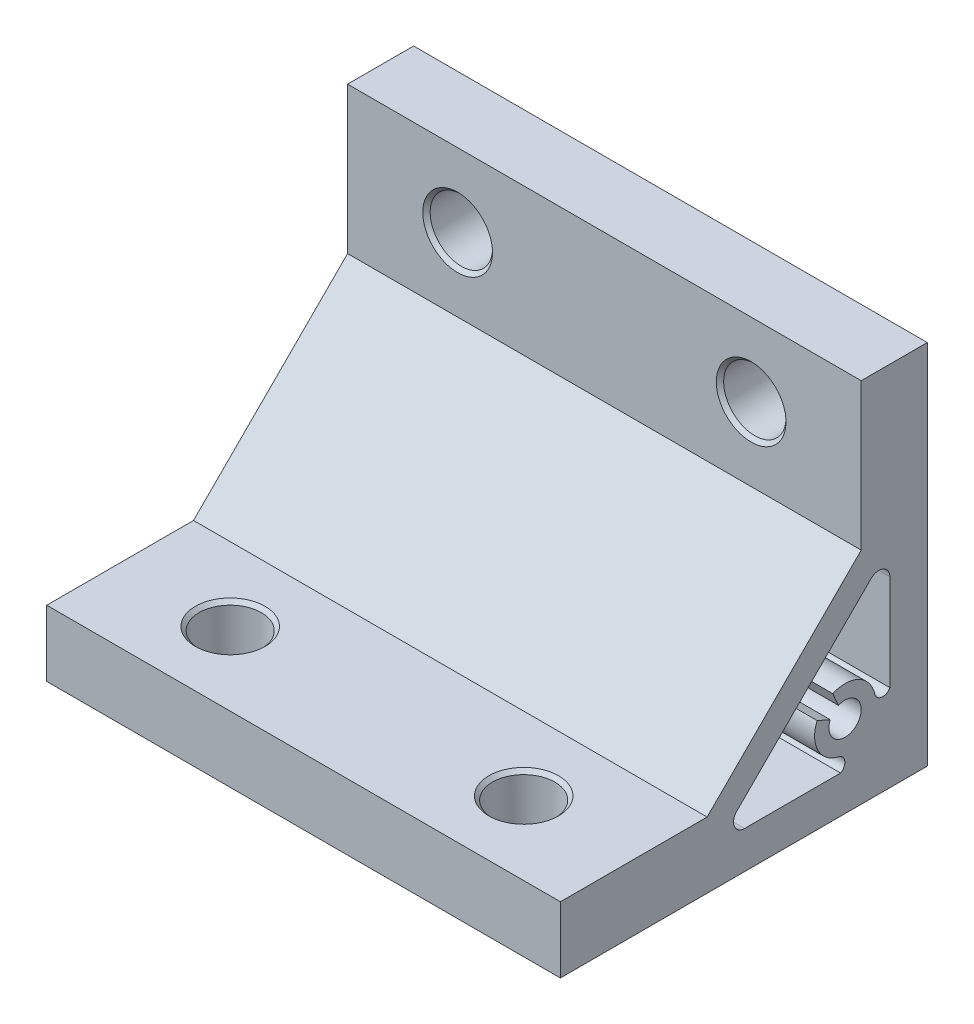
ISO-10303-21;
HEADER;
FILE_DESCRIPTION(('STEP AP214'),'2;1');
FILE_NAME('part.step','',(''),(''),'','','');
FILE_SCHEMA(('AUTOMOTIVE_DESIGN { 1 0 10303 214 1 1 1 1 }'));
ENDSEC;
DATA;
#1=APPLICATION_CONTEXT('core data for automotive mechanical design processes');
#2=APPLICATION_PROTOCOL_DEFINITION('international standard','automotive_design',2000,#1);
#3=PRODUCT_CONTEXT('',#1,'mechanical');
#4=PRODUCT('Part','Part','',(#3));
#5=PRODUCT_RELATED_PRODUCT_CATEGORY('part','',(#4));
#6=PRODUCT_DEFINITION_FORMATION('','',#4);
#7=PRODUCT_DEFINITION_CONTEXT('part definition',#1,'design');
#8=PRODUCT_DEFINITION('design','',#6,#7);
#9=PRODUCT_DEFINITION_SHAPE('','',#8);
#10=(LENGTH_UNIT() NAMED_UNIT(*) SI_UNIT(.MILLI.,.METRE.));
#11=(NAMED_UNIT(*) PLANE_ANGLE_UNIT() SI_UNIT($,.RADIAN.));
#12=(NAMED_UNIT(*) SI_UNIT($,.STERADIAN.) SOLID_ANGLE_UNIT());
#13=UNCERTAINTY_MEASURE_WITH_UNIT(LENGTH_MEASURE(1.E-05),#10,'distance_accuracy_value','');
#14=(GEOMETRIC_REPRESENTATION_CONTEXT(3) GLOBAL_UNCERTAINTY_ASSIGNED_CONTEXT((#13)) GLOBAL_UNIT_ASSIGNED_CONTEXT((#10,
#11,#12)) REPRESENTATION_CONTEXT('',''));
#15=CARTESIAN_POINT('',(0.,0.,0.));
#16=DIRECTION('',(0.,0.,1.));
#17=DIRECTION('',(1.,0.,0.));
#18=AXIS2_PLACEMENT_3D('',#15,#16,#17);
#19=CARTESIAN_POINT('',(20.,9.,25.));
#20=DIRECTION('',(0.,0.,-1.));
#21=DIRECTION('',(0.,1.,0.));
#22=AXIS2_PLACEMENT_3D('',#19,#20,#21);
#23=PLANE('',#22);
#24=DIRECTION('',(0.,-1.,0.));
#25=VECTOR('',#24,1.);
#26=CARTESIAN_POINT('',(-15.,50.,25.));
#27=LINE('',#26,#25);
#28=CARTESIAN_POINT('',(-15.,9.,25.));
#29=VERTEX_POINT('',#28);
#30=CARTESIAN_POINT('',(-15.,0.,25.));
#31=VERTEX_POINT('',#30);
#32=EDGE_CURVE('E39',#29,#31,#27,.T.);
#33=ORIENTED_EDGE('',*,*,#32,.T.);
#34=DIRECTION('',(-1.,0.,0.));
#35=VECTOR('',#34,1.);
#36=CARTESIAN_POINT('',(20.,0.,25.));
#37=LINE('',#36,#35);
#38=CARTESIAN_POINT('',(55.,0.,25.));
#39=VERTEX_POINT('',#38);
#40=EDGE_CURVE('E164',#39,#31,#37,.T.);
#41=ORIENTED_EDGE('',*,*,#40,.F.);
#42=DIRECTION('',(0.,1.,0.));
#43=VECTOR('',#42,1.);
#44=CARTESIAN_POINT('',(55.,50.,25.));
#45=LINE('',#44,#43);
#46=CARTESIAN_POINT('',(55.,9.,25.));
#47=VERTEX_POINT('',#46);
#48=EDGE_CURVE('E155',#39,#47,#45,.T.);
#49=ORIENTED_EDGE('',*,*,#48,.T.);
#50=DIRECTION('',(-1.,0.,0.));
#51=VECTOR('',#50,1.);
#52=CARTESIAN_POINT('',(20.,9.,25.));
#53=LINE('',#52,#51);
#54=EDGE_CURVE('E298',#47,#29,#53,.T.);
#55=ORIENTED_EDGE('',*,*,#54,.T.);
#56=EDGE_LOOP('',(#33,#41,#49,#55));
#57=FACE_BOUND('',#56,.T.);
#58=ADVANCED_FACE('F16',(#57),#23,.F.);
#59=CARTESIAN_POINT('',(20.,0.,25.));
#60=DIRECTION('',(0.,1.,0.));
#61=DIRECTION('',(0.,0.,1.));
#62=AXIS2_PLACEMENT_3D('',#59,#60,#61);
#63=PLANE('',#62);
#64=CARTESIAN_POINT('',(0.,0.,15.));
#65=DIRECTION('',(0.,1.,0.));
#66=DIRECTION('',(0.,0.,1.));
#67=AXIS2_PLACEMENT_3D('',#64,#65,#66);
#68=CIRCLE('',#67,4.75);
#69=CARTESIAN_POINT('',(0.,0.,19.75));
#70=VERTEX_POINT('',#69);
#71=EDGE_CURVE('E188',#70,#70,#68,.T.);
#72=ORIENTED_EDGE('',*,*,#71,.T.);
#73=EDGE_LOOP('',(#72));
#74=FACE_BOUND('',#73,.T.);
#75=CARTESIAN_POINT('',(40.,0.,15.));
#76=DIRECTION('',(0.,-1.,0.));
#77=DIRECTION('',(0.,0.,1.));
#78=AXIS2_PLACEMENT_3D('',#75,#76,#77);
#79=CIRCLE('',#78,4.75);
#80=CARTESIAN_POINT('',(40.,0.,19.75));
#81=VERTEX_POINT('',#80);
#82=EDGE_CURVE('E271',#81,#81,#79,.T.);
#83=ORIENTED_EDGE('',*,*,#82,.F.);
#84=EDGE_LOOP('',(#83));
#85=FACE_BOUND('',#84,.T.);
#86=DIRECTION('',(0.,0.,1.));
#87=VECTOR('',#86,1.);
#88=CARTESIAN_POINT('',(-15.,0.,-25.));
#89=LINE('',#88,#87);
#90=CARTESIAN_POINT('',(-15.,0.,-25.));
#91=VERTEX_POINT('',#90);
#92=EDGE_CURVE('E147',#91,#31,#89,.T.);
#93=ORIENTED_EDGE('',*,*,#92,.F.);
#94=DIRECTION('',(-1.,0.,0.));
#95=VECTOR('',#94,1.);
#96=CARTESIAN_POINT('',(20.,0.,-25.));
#97=LINE('',#96,#95);
#98=CARTESIAN_POINT('',(55.,0.,-25.));
#99=VERTEX_POINT('',#98);
#100=EDGE_CURVE('E162',#99,#91,#97,.T.);
#101=ORIENTED_EDGE('',*,*,#100,.F.);
#102=DIRECTION('',(0.,0.,1.));
#103=VECTOR('',#102,1.);
#104=CARTESIAN_POINT('',(55.,0.,-25.));
#105=LINE('',#104,#103);
#106=EDGE_CURVE('E165',#99,#39,#105,.T.);
#107=ORIENTED_EDGE('',*,*,#106,.T.);
#108=ORIENTED_EDGE('',*,*,#40,.T.);
#109=EDGE_LOOP('',(#93,#101,#107,#108));
#110=FACE_BOUND('',#109,.T.);
#111=ADVANCED_FACE('F160',(#74,#85,#110),#63,.F.);
#112=CARTESIAN_POINT('',(20.,0.,-25.));
#113=DIRECTION('',(0.,0.,1.));
#114=DIRECTION('',(0.,-1.,0.));
#115=AXIS2_PLACEMENT_3D('',#112,#113,#114);
#116=PLANE('',#115);
#117=CARTESIAN_POINT('',(0.,40.,-25.));
#118=DIRECTION('',(0.,0.,1.));
#119=DIRECTION('',(0.,-1.,0.));
#120=AXIS2_PLACEMENT_3D('',#117,#118,#119);
#121=CIRCLE('',#120,4.74999999999999);
#122=CARTESIAN_POINT('',(0.,35.25,-25.));
#123=VERTEX_POINT('',#122);
#124=EDGE_CURVE('E197',#123,#123,#121,.T.);
#125=ORIENTED_EDGE('',*,*,#124,.T.);
#126=EDGE_LOOP('',(#125));
#127=FACE_BOUND('',#126,.T.);
#128=CARTESIAN_POINT('',(40.,40.,-25.));
#129=DIRECTION('',(0.,0.,-1.));
#130=DIRECTION('',(0.,-1.,0.));
#131=AXIS2_PLACEMENT_3D('',#128,#129,#130);
#132=CIRCLE('',#131,4.74999999999999);
#133=CARTESIAN_POINT('',(40.,35.25,-25.));
#134=VERTEX_POINT('',#133);
#135=EDGE_CURVE('E280',#134,#134,#132,.T.);
#136=ORIENTED_EDGE('',*,*,#135,.F.);
#137=EDGE_LOOP('',(#136));
#138=FACE_BOUND('',#137,.T.);
#139=DIRECTION('',(0.,-1.,0.));
#140=VECTOR('',#139,1.);
#141=CARTESIAN_POINT('',(-15.,50.,-25.));
#142=LINE('',#141,#140);
#143=CARTESIAN_POINT('',(-15.,50.,-25.));
#144=VERTEX_POINT('',#143);
#145=EDGE_CURVE('E144',#144,#91,#142,.T.);
#146=ORIENTED_EDGE('',*,*,#145,.F.);
#147=DIRECTION('',(-1.,0.,0.));
#148=VECTOR('',#147,1.);
#149=CARTESIAN_POINT('',(20.,50.,-25.));
#150=LINE('',#149,#148);
#151=CARTESIAN_POINT('',(55.,50.,-25.));
#152=VERTEX_POINT('',#151);
#153=EDGE_CURVE('E169',#152,#144,#150,.T.);
#154=ORIENTED_EDGE('',*,*,#153,.F.);
#155=DIRECTION('',(0.,1.,0.));
#156=VECTOR('',#155,1.);
#157=CARTESIAN_POINT('',(55.,50.,-25.));
#158=LINE('',#157,#156);
#159=EDGE_CURVE('E154',#99,#152,#158,.T.);
#160=ORIENTED_EDGE('',*,*,#159,.F.);
#161=ORIENTED_EDGE('',*,*,#100,.T.);
#162=EDGE_LOOP('',(#146,#154,#160,#161));
#163=FACE_BOUND('',#162,.T.);
#164=ADVANCED_FACE('F168',(#127,#138,#163),#116,.F.);
#165=CARTESIAN_POINT('',(20.,50.,-25.));
#166=DIRECTION('',(0.,-1.,0.));
#167=DIRECTION('',(0.,0.,-1.));
#168=AXIS2_PLACEMENT_3D('',#165,#166,#167);
#169=PLANE('',#168);
#170=DIRECTION('',(0.,0.,1.));
#171=VECTOR('',#170,1.);
#172=CARTESIAN_POINT('',(-15.,50.,-25.));
#173=LINE('',#172,#171);
#174=CARTESIAN_POINT('',(-15.,50.,-16.));
#175=VERTEX_POINT('',#174);
#176=EDGE_CURVE('E149',#144,#175,#173,.T.);
#177=ORIENTED_EDGE('',*,*,#176,.T.);
#178=DIRECTION('',(-1.,0.,0.));
#179=VECTOR('',#178,1.);
#180=CARTESIAN_POINT('',(20.,50.,-16.));
#181=LINE('',#180,#179);
#182=CARTESIAN_POINT('',(55.,50.,-16.));
#183=VERTEX_POINT('',#182);
#184=EDGE_CURVE('E173',#183,#175,#181,.T.);
#185=ORIENTED_EDGE('',*,*,#184,.F.);
#186=DIRECTION('',(0.,0.,1.));
#187=VECTOR('',#186,1.);
#188=CARTESIAN_POINT('',(55.,50.,-25.));
#189=LINE('',#188,#187);
#190=EDGE_CURVE('E335',#152,#183,#189,.T.);
#191=ORIENTED_EDGE('',*,*,#190,.F.);
#192=ORIENTED_EDGE('',*,*,#153,.T.);
#193=EDGE_LOOP('',(#177,#185,#191,#192));
#194=FACE_BOUND('',#193,.T.);
#195=ADVANCED_FACE('F334',(#194),#169,.F.);
#196=CARTESIAN_POINT('',(20.,50.,-16.));
#197=DIRECTION('',(0.,0.,-1.));
#198=DIRECTION('',(0.,1.,0.));
#199=AXIS2_PLACEMENT_3D('',#196,#197,#198);
#200=PLANE('',#199);
#201=CARTESIAN_POINT('',(0.,40.,-16.));
#202=DIRECTION('',(0.,0.,-1.));
#203=DIRECTION('',(0.,1.,0.));
#204=AXIS2_PLACEMENT_3D('',#201,#202,#203);
#205=CIRCLE('',#204,4.75000000000003);
#206=CARTESIAN_POINT('',(0.,44.75,-16.));
#207=VERTEX_POINT('',#206);
#208=EDGE_CURVE('E209',#207,#207,#205,.T.);
#209=ORIENTED_EDGE('',*,*,#208,.T.);
#210=EDGE_LOOP('',(#209));
#211=FACE_BOUND('',#210,.T.);
#212=CARTESIAN_POINT('',(40.,40.,-16.));
#213=DIRECTION('',(0.,0.,1.));
#214=DIRECTION('',(0.,1.,0.));
#215=AXIS2_PLACEMENT_3D('',#212,#213,#214);
#216=CIRCLE('',#215,4.75000000000003);
#217=CARTESIAN_POINT('',(40.,44.75,-16.));
#218=VERTEX_POINT('',#217);
#219=EDGE_CURVE('E292',#218,#218,#216,.T.);
#220=ORIENTED_EDGE('',*,*,#219,.F.);
#221=EDGE_LOOP('',(#220));
#222=FACE_BOUND('',#221,.T.);
#223=DIRECTION('',(0.,1.,0.));
#224=VECTOR('',#223,1.);
#225=CARTESIAN_POINT('',(-15.,50.,-16.));
#226=LINE('',#225,#224);
#227=CARTESIAN_POINT('',(-15.,30.,-16.));
#228=VERTEX_POINT('',#227);
#229=EDGE_CURVE('E269',#228,#175,#226,.T.);
#230=ORIENTED_EDGE('',*,*,#229,.F.);
#231=DIRECTION('',(-1.,0.,0.));
#232=VECTOR('',#231,1.);
#233=CARTESIAN_POINT('',(20.,30.,-16.));
#234=LINE('',#233,#232);
#235=CARTESIAN_POINT('',(55.,30.,-16.));
#236=VERTEX_POINT('',#235);
#237=EDGE_CURVE('E323',#236,#228,#234,.T.);
#238=ORIENTED_EDGE('',*,*,#237,.F.);
#239=DIRECTION('',(0.,-1.,0.));
#240=VECTOR('',#239,1.);
#241=CARTESIAN_POINT('',(55.,50.,-16.));
#242=LINE('',#241,#240);
#243=EDGE_CURVE('E242',#183,#236,#242,.T.);
#244=ORIENTED_EDGE('',*,*,#243,.F.);
#245=ORIENTED_EDGE('',*,*,#184,.T.);
#246=EDGE_LOOP('',(#230,#238,#244,#245));
#247=FACE_BOUND('',#246,.T.);
#248=ADVANCED_FACE('F330',(#211,#222,#247),#200,.F.);
#249=CARTESIAN_POINT('',(20.,30.,-16.));
#250=DIRECTION('',(0.,-0.707106781186547,-0.707106781186548));
#251=DIRECTION('',(0.,0.707106781186548,-0.707106781186547));
#252=AXIS2_PLACEMENT_3D('',#249,#250,#251);
#253=PLANE('',#252);
#254=DIRECTION('',(0.,0.707106781186548,-0.707106781186547));
#255=VECTOR('',#254,1.);
#256=CARTESIAN_POINT('',(-15.,30.,-16.));
#257=LINE('',#256,#255);
#258=CARTESIAN_POINT('',(-15.,9.,5.));
#259=VERTEX_POINT('',#258);
#260=EDGE_CURVE('E267',#259,#228,#257,.T.);
#261=ORIENTED_EDGE('',*,*,#260,.F.);
#262=DIRECTION('',(-1.,0.,0.));
#263=VECTOR('',#262,1.);
#264=CARTESIAN_POINT('',(20.,9.,5.));
#265=LINE('',#264,#263);
#266=CARTESIAN_POINT('',(55.,9.,5.));
#267=VERTEX_POINT('',#266);
#268=EDGE_CURVE('E320',#267,#259,#265,.T.);
#269=ORIENTED_EDGE('',*,*,#268,.F.);
#270=DIRECTION('',(0.,-0.707106781186548,0.707106781186547));
#271=VECTOR('',#270,1.);
#272=CARTESIAN_POINT('',(55.,30.,-16.));
#273=LINE('',#272,#271);
#274=EDGE_CURVE('E31',#236,#267,#273,.T.);
#275=ORIENTED_EDGE('',*,*,#274,.F.);
#276=ORIENTED_EDGE('',*,*,#237,.T.);
#277=EDGE_LOOP('',(#261,#269,#275,#276));
#278=FACE_BOUND('',#277,.T.);
#279=ADVANCED_FACE('F368',(#278),#253,.F.);
#280=CARTESIAN_POINT('',(20.,9.,5.));
#281=DIRECTION('',(0.,-1.,0.));
#282=DIRECTION('',(0.,0.,-1.));
#283=AXIS2_PLACEMENT_3D('',#280,#281,#282);
#284=PLANE('',#283);
#285=CARTESIAN_POINT('',(0.,9.,15.));
#286=DIRECTION('',(0.,-1.,0.));
#287=DIRECTION('',(0.,0.,-1.));
#288=AXIS2_PLACEMENT_3D('',#285,#286,#287);
#289=CIRCLE('',#288,4.75000000000001);
#290=CARTESIAN_POINT('',(0.,9.,10.25));
#291=VERTEX_POINT('',#290);
#292=EDGE_CURVE('E206',#291,#291,#289,.T.);
#293=ORIENTED_EDGE('',*,*,#292,.T.);
#294=EDGE_LOOP('',(#293));
#295=FACE_BOUND('',#294,.T.);
#296=CARTESIAN_POINT('',(40.,9.,15.));
#297=DIRECTION('',(0.,1.,0.));
#298=DIRECTION('',(0.,0.,-1.));
#299=AXIS2_PLACEMENT_3D('',#296,#297,#298);
#300=CIRCLE('',#299,4.75000000000001);
#301=CARTESIAN_POINT('',(40.,9.,10.25));
#302=VERTEX_POINT('',#301);
#303=EDGE_CURVE('E289',#302,#302,#300,.T.);
#304=ORIENTED_EDGE('',*,*,#303,.F.);
#305=EDGE_LOOP('',(#304));
#306=FACE_BOUND('',#305,.T.);
#307=DIRECTION('',(0.,0.,-1.));
#308=VECTOR('',#307,1.);
#309=CARTESIAN_POINT('',(-15.,9.,5.));
#310=LINE('',#309,#308);
#311=EDGE_CURVE('E265',#29,#259,#310,.T.);
#312=ORIENTED_EDGE('',*,*,#311,.F.);
#313=ORIENTED_EDGE('',*,*,#54,.F.);
#314=DIRECTION('',(0.,0.,1.));
#315=VECTOR('',#314,1.);
#316=CARTESIAN_POINT('',(55.,9.,5.));
#317=LINE('',#316,#315);
#318=EDGE_CURVE('E359',#267,#47,#317,.T.);
#319=ORIENTED_EDGE('',*,*,#318,.F.);
#320=ORIENTED_EDGE('',*,*,#268,.T.);
#321=EDGE_LOOP('',(#312,#313,#319,#320));
#322=FACE_BOUND('',#321,.T.);
#323=ADVANCED_FACE('F365',(#295,#306,#322),#284,.F.);
#324=CARTESIAN_POINT('',(0.,40.,-25.));
#325=DIRECTION('',(0.,0.,1.));
#326=DIRECTION('',(1.,0.,0.));
#327=AXIS2_PLACEMENT_3D('',#324,#325,#326);
#328=CYLINDRICAL_SURFACE('',#327,4.25);
#329=CARTESIAN_POINT('',(0.,40.,-24.5));
#330=DIRECTION('',(0.,0.,1.));
#331=DIRECTION('',(1.,0.,0.));
#332=AXIS2_PLACEMENT_3D('',#329,#330,#331);
#333=CIRCLE('',#332,4.25);
#334=CARTESIAN_POINT('',(4.25000000000001,40.,-24.5));
#335=VERTEX_POINT('',#334);
#336=EDGE_CURVE('E203',#335,#335,#333,.F.);
#337=ORIENTED_EDGE('',*,*,#336,.T.);
#338=EDGE_LOOP('',(#337));
#339=FACE_BOUND('',#338,.T.);
#340=CARTESIAN_POINT('',(0.,40.,-16.5));
#341=DIRECTION('',(0.,0.,-1.));
#342=DIRECTION('',(-1.,0.,0.));
#343=AXIS2_PLACEMENT_3D('',#340,#341,#342);
#344=CIRCLE('',#343,4.25);
#345=CARTESIAN_POINT('',(-4.25,40.,-16.5));
#346=VERTEX_POINT('',#345);
#347=EDGE_CURVE('E200',#346,#346,#344,.F.);
#348=ORIENTED_EDGE('',*,*,#347,.T.);
#349=EDGE_LOOP('',(#348));
#350=FACE_BOUND('',#349,.T.);
#351=ADVANCED_FACE('F376',(#339,#350),#328,.F.);
#352=CARTESIAN_POINT('',(0.,0.,15.));
#353=DIRECTION('',(0.,1.,0.));
#354=DIRECTION('',(0.,0.,1.));
#355=AXIS2_PLACEMENT_3D('',#352,#353,#354);
#356=CYLINDRICAL_SURFACE('',#355,4.25);
#357=CARTESIAN_POINT('',(0.,0.500000000000009,15.));
#358=DIRECTION('',(0.,1.,0.));
#359=DIRECTION('',(0.,0.,1.));
#360=AXIS2_PLACEMENT_3D('',#357,#358,#359);
#361=CIRCLE('',#360,4.25);
#362=CARTESIAN_POINT('',(0.,0.500000000000009,19.25));
#363=VERTEX_POINT('',#362);
#364=EDGE_CURVE('E194',#363,#363,#361,.F.);
#365=ORIENTED_EDGE('',*,*,#364,.T.);
#366=EDGE_LOOP('',(#365));
#367=FACE_BOUND('',#366,.T.);
#368=CARTESIAN_POINT('',(0.,8.49999999999999,15.));
#369=DIRECTION('',(0.,-1.,0.));
#370=DIRECTION('',(0.,0.,-1.));
#371=AXIS2_PLACEMENT_3D('',#368,#369,#370);
#372=CIRCLE('',#371,4.25);
#373=CARTESIAN_POINT('',(0.,8.49999999999999,10.75));
#374=VERTEX_POINT('',#373);
#375=EDGE_CURVE('E191',#374,#374,#372,.F.);
#376=ORIENTED_EDGE('',*,*,#375,.T.);
#377=EDGE_LOOP('',(#376));
#378=FACE_BOUND('',#377,.T.);
#379=ADVANCED_FACE('F400',(#367,#378),#356,.F.);
#380=CARTESIAN_POINT('',(0.,0.,15.));
#381=DIRECTION('',(0.,-1.,0.));
#382=DIRECTION('',(0.,0.,-1.));
#383=AXIS2_PLACEMENT_3D('',#380,#381,#382);
#384=CONICAL_SURFACE('',#383,4.75,0.785398163397436);
#385=ORIENTED_EDGE('',*,*,#364,.F.);
#386=EDGE_LOOP('',(#385));
#387=FACE_BOUND('',#386,.T.);
#388=ORIENTED_EDGE('',*,*,#71,.F.);
#389=EDGE_LOOP('',(#388));
#390=FACE_BOUND('',#389,.T.);
#391=ADVANCED_FACE('F396',(#387,#390),#384,.F.);
#392=CARTESIAN_POINT('',(0.,40.,-25.));
#393=DIRECTION('',(0.,0.,-1.));
#394=DIRECTION('',(-1.,0.,0.));
#395=AXIS2_PLACEMENT_3D('',#392,#393,#394);
#396=CONICAL_SURFACE('',#395,4.74999999999999,0.785398163397445);
#397=ORIENTED_EDGE('',*,*,#336,.F.);
#398=EDGE_LOOP('',(#397));
#399=FACE_BOUND('',#398,.T.);
#400=ORIENTED_EDGE('',*,*,#124,.F.);
#401=EDGE_LOOP('',(#400));
#402=FACE_BOUND('',#401,.T.);
#403=ADVANCED_FACE('F399',(#399,#402),#396,.F.);
#404=CARTESIAN_POINT('',(0.,8.49999999999999,15.));
#405=DIRECTION('',(0.,1.,0.));
#406=DIRECTION('',(0.,0.,1.));
#407=AXIS2_PLACEMENT_3D('',#404,#405,#406);
#408=CONICAL_SURFACE('',#407,4.25,0.785398163397449);
#409=ORIENTED_EDGE('',*,*,#292,.F.);
#410=EDGE_LOOP('',(#409));
#411=FACE_BOUND('',#410,.T.);
#412=ORIENTED_EDGE('',*,*,#375,.F.);
#413=EDGE_LOOP('',(#412));
#414=FACE_BOUND('',#413,.T.);
#415=ADVANCED_FACE('F403',(#411,#414),#408,.F.);
#416=CARTESIAN_POINT('',(0.,40.,-16.5));
#417=DIRECTION('',(0.,0.,1.));
#418=DIRECTION('',(1.,0.,0.));
#419=AXIS2_PLACEMENT_3D('',#416,#417,#418);
#420=CONICAL_SURFACE('',#419,4.25,0.785398163397448);
#421=ORIENTED_EDGE('',*,*,#208,.F.);
#422=EDGE_LOOP('',(#421));
#423=FACE_BOUND('',#422,.T.);
#424=ORIENTED_EDGE('',*,*,#347,.F.);
#425=EDGE_LOOP('',(#424));
#426=FACE_BOUND('',#425,.T.);
#427=ADVANCED_FACE('F18',(#423,#426),#420,.F.);
#428=CARTESIAN_POINT('',(40.,40.,-25.));
#429=DIRECTION('',(0.,0.,1.));
#430=DIRECTION('',(-1.,0.,0.));
#431=AXIS2_PLACEMENT_3D('',#428,#429,#430);
#432=CYLINDRICAL_SURFACE('',#431,4.25);
#433=CARTESIAN_POINT('',(40.,40.,-24.5));
#434=DIRECTION('',(0.,0.,-1.));
#435=DIRECTION('',(-1.,0.,0.));
#436=AXIS2_PLACEMENT_3D('',#433,#434,#435);
#437=CIRCLE('',#436,4.25);
#438=CARTESIAN_POINT('',(35.75,40.,-24.5));
#439=VERTEX_POINT('',#438);
#440=EDGE_CURVE('E286',#439,#439,#437,.F.);
#441=ORIENTED_EDGE('',*,*,#440,.F.);
#442=EDGE_LOOP('',(#441));
#443=FACE_BOUND('',#442,.T.);
#444=CARTESIAN_POINT('',(40.,40.,-16.5));
#445=DIRECTION('',(0.,0.,1.));
#446=DIRECTION('',(1.,0.,0.));
#447=AXIS2_PLACEMENT_3D('',#444,#445,#446);
#448=CIRCLE('',#447,4.25);
#449=CARTESIAN_POINT('',(44.25,40.,-16.5));
#450=VERTEX_POINT('',#449);
#451=EDGE_CURVE('E283',#450,#450,#448,.F.);
#452=ORIENTED_EDGE('',*,*,#451,.F.);
#453=EDGE_LOOP('',(#452));
#454=FACE_BOUND('',#453,.T.);
#455=ADVANCED_FACE('F410',(#443,#454),#432,.F.);
#456=CARTESIAN_POINT('',(40.,0.,15.));
#457=DIRECTION('',(0.,1.,0.));
#458=DIRECTION('',(0.,0.,1.));
#459=AXIS2_PLACEMENT_3D('',#456,#457,#458);
#460=CYLINDRICAL_SURFACE('',#459,4.25);
#461=CARTESIAN_POINT('',(40.,0.500000000000009,15.));
#462=DIRECTION('',(0.,-1.,0.));
#463=DIRECTION('',(0.,0.,1.));
#464=AXIS2_PLACEMENT_3D('',#461,#462,#463);
#465=CIRCLE('',#464,4.25);
#466=CARTESIAN_POINT('',(40.,0.500000000000009,19.25));
#467=VERTEX_POINT('',#466);
#468=EDGE_CURVE('E277',#467,#467,#465,.F.);
#469=ORIENTED_EDGE('',*,*,#468,.F.);
#470=EDGE_LOOP('',(#469));
#471=FACE_BOUND('',#470,.T.);
#472=CARTESIAN_POINT('',(40.,8.49999999999999,15.));
#473=DIRECTION('',(0.,1.,0.));
#474=DIRECTION('',(0.,0.,-1.));
#475=AXIS2_PLACEMENT_3D('',#472,#473,#474);
#476=CIRCLE('',#475,4.25);
#477=CARTESIAN_POINT('',(40.,8.49999999999999,10.75));
#478=VERTEX_POINT('',#477);
#479=EDGE_CURVE('E274',#478,#478,#476,.F.);
#480=ORIENTED_EDGE('',*,*,#479,.F.);
#481=EDGE_LOOP('',(#480));
#482=FACE_BOUND('',#481,.T.);
#483=ADVANCED_FACE('F568',(#471,#482),#460,.F.);
#484=CARTESIAN_POINT('',(40.,0.,15.));
#485=DIRECTION('',(0.,-1.,0.));
#486=DIRECTION('',(0.,0.,-1.));
#487=AXIS2_PLACEMENT_3D('',#484,#485,#486);
#488=CONICAL_SURFACE('',#487,4.75,0.785398163397436);
#489=ORIENTED_EDGE('',*,*,#468,.T.);
#490=EDGE_LOOP('',(#489));
#491=FACE_BOUND('',#490,.T.);
#492=ORIENTED_EDGE('',*,*,#82,.T.);
#493=EDGE_LOOP('',(#492));
#494=FACE_BOUND('',#493,.T.);
#495=ADVANCED_FACE('F559',(#491,#494),#488,.F.);
#496=CARTESIAN_POINT('',(40.,40.,-25.));
#497=DIRECTION('',(0.,0.,-1.));
#498=DIRECTION('',(1.,0.,0.));
#499=AXIS2_PLACEMENT_3D('',#496,#497,#498);
#500=CONICAL_SURFACE('',#499,4.74999999999999,0.785398163397445);
#501=ORIENTED_EDGE('',*,*,#440,.T.);
#502=EDGE_LOOP('',(#501));
#503=FACE_BOUND('',#502,.T.);
#504=ORIENTED_EDGE('',*,*,#135,.T.);
#505=EDGE_LOOP('',(#504));
#506=FACE_BOUND('',#505,.T.);
#507=ADVANCED_FACE('F551',(#503,#506),#500,.F.);
#508=CARTESIAN_POINT('',(40.,8.49999999999999,15.));
#509=DIRECTION('',(0.,1.,0.));
#510=DIRECTION('',(0.,0.,1.));
#511=AXIS2_PLACEMENT_3D('',#508,#509,#510);
#512=CONICAL_SURFACE('',#511,4.25,0.785398163397449);
#513=ORIENTED_EDGE('',*,*,#303,.T.);
#514=EDGE_LOOP('',(#513));
#515=FACE_BOUND('',#514,.T.);
#516=ORIENTED_EDGE('',*,*,#479,.T.);
#517=EDGE_LOOP('',(#516));
#518=FACE_BOUND('',#517,.T.);
#519=ADVANCED_FACE('F543',(#515,#518),#512,.F.);
#520=CARTESIAN_POINT('',(40.,40.,-16.5));
#521=DIRECTION('',(0.,0.,1.));
#522=DIRECTION('',(-1.,0.,0.));
#523=AXIS2_PLACEMENT_3D('',#520,#521,#522);
#524=CONICAL_SURFACE('',#523,4.25,0.785398163397448);
#525=ORIENTED_EDGE('',*,*,#219,.T.);
#526=EDGE_LOOP('',(#525));
#527=FACE_BOUND('',#526,.T.);
#528=ORIENTED_EDGE('',*,*,#451,.T.);
#529=EDGE_LOOP('',(#528));
#530=FACE_BOUND('',#529,.T.);
#531=ADVANCED_FACE('F425',(#527,#530),#524,.F.);
#532=CARTESIAN_POINT('',(55.,50.,-25.));
#533=DIRECTION('',(1.,0.,0.));
#534=DIRECTION('',(0.,1.,0.));
#535=AXIS2_PLACEMENT_3D('',#532,#533,#534);
#536=PLANE('',#535);
#537=CARTESIAN_POINT('',(55.,24.9046681194226,-18.4));
#538=DIRECTION('',(1.,0.,0.));
#539=DIRECTION('',(0.,1.,0.));
#540=AXIS2_PLACEMENT_3D('',#537,#538,#539);
#541=CIRCLE('',#540,1.5);
#542=CARTESIAN_POINT('',(55.,25.9653282912024,-17.3393398282202));
#543=VERTEX_POINT('',#542);
#544=CARTESIAN_POINT('',(55.,24.9046681194226,-19.9));
#545=VERTEX_POINT('',#544);
#546=EDGE_CURVE('E226',#543,#545,#541,.F.);
#547=ORIENTED_EDGE('',*,*,#546,.T.);
#548=DIRECTION('',(0.,-1.,0.));
#549=VECTOR('',#548,1.);
#550=CARTESIAN_POINT('',(55.,11.8175144212722,-19.9));
#551=LINE('',#550,#549);
#552=CARTESIAN_POINT('',(55.,11.8175144212722,-19.9));
#553=VERTEX_POINT('',#552);
#554=EDGE_CURVE('E227',#545,#553,#551,.T.);
#555=ORIENTED_EDGE('',*,*,#554,.T.);
#556=CARTESIAN_POINT('',(55.,12.3315574267284,-18.9238670543259));
#557=DIRECTION('',(1.,0.,0.));
#558=DIRECTION('',(0.,1.,0.));
#559=AXIS2_PLACEMENT_3D('',#556,#557,#558);
#560=CIRCLE('',#559,1.10321155681434);
#561=CARTESIAN_POINT('',(55.,12.1057315128375,-17.8440159554683));
#562=VERTEX_POINT('',#561);
#563=EDGE_CURVE('E355',#553,#562,#560,.F.);
#564=ORIENTED_EDGE('',*,*,#563,.T.);
#565=CARTESIAN_POINT('',(55.,11.2076424818068,-13.7923575181932));
#566=DIRECTION('',(1.,0.,0.));
#567=DIRECTION('',(0.,1.,0.));
#568=AXIS2_PLACEMENT_3D('',#565,#566,#567);
#569=CIRCLE('',#568,4.15);
#570=CARTESIAN_POINT('',(55.,15.0044038944035,-12.1169164491561));
#571=VERTEX_POINT('',#570);
#572=EDGE_CURVE('E353',#562,#571,#569,.T.);
#573=ORIENTED_EDGE('',*,*,#572,.T.);
#574=DIRECTION('',(0.,-0.914882268095605,-0.403720739527018));
#575=VECTOR('',#574,1.);
#576=CARTESIAN_POINT('',(55.,15.0044038944035,-12.1169164491561));
#577=LINE('',#576,#575);
#578=CARTESIAN_POINT('',(55.,13.2203834716171,-12.9041718912338));
#579=VERTEX_POINT('',#578);
#580=EDGE_CURVE('E351',#571,#579,#577,.T.);
#581=ORIENTED_EDGE('',*,*,#580,.T.);
#582=CARTESIAN_POINT('',(55.,11.2076424818068,-13.7923575181932));
#583=DIRECTION('',(1.,0.,0.));
#584=DIRECTION('',(0.,1.,0.));
#585=AXIS2_PLACEMENT_3D('',#582,#583,#584);
#586=CIRCLE('',#585,2.2);
#587=CARTESIAN_POINT('',(55.,12.0958281087662,-11.7796165283829));
#588=VERTEX_POINT('',#587);
#589=EDGE_CURVE('E349',#579,#588,#586,.F.);
#590=ORIENTED_EDGE('',*,*,#589,.T.);
#591=DIRECTION('',(0.,0.403720739527015,0.914882268095606));
#592=VECTOR('',#591,1.);
#593=CARTESIAN_POINT('',(55.,12.8830835508439,-9.99559610559646));
#594=LINE('',#593,#592);
#595=CARTESIAN_POINT('',(55.,12.8830835508439,-9.99559610559646));
#596=VERTEX_POINT('',#595);
#597=EDGE_CURVE('E347',#588,#596,#594,.T.);
#598=ORIENTED_EDGE('',*,*,#597,.T.);
#599=CARTESIAN_POINT('',(55.,11.2076424818068,-13.7923575181932));
#600=DIRECTION('',(1.,0.,0.));
#601=DIRECTION('',(0.,1.,0.));
#602=AXIS2_PLACEMENT_3D('',#599,#600,#601);
#603=CIRCLE('',#602,4.15);
#604=CARTESIAN_POINT('',(55.,7.15598404453171,-12.8942684871625));
#605=VERTEX_POINT('',#604);
#606=EDGE_CURVE('E345',#596,#605,#603,.T.);
#607=ORIENTED_EDGE('',*,*,#606,.T.);
#608=CARTESIAN_POINT('',(55.,6.07613294567405,-12.6684425732716));
#609=DIRECTION('',(1.,0.,0.));
#610=DIRECTION('',(0.,1.,0.));
#611=AXIS2_PLACEMENT_3D('',#608,#609,#610);
#612=CIRCLE('',#611,1.10321155681434);
#613=CARTESIAN_POINT('',(55.,5.1,-13.1824855787278));
#614=VERTEX_POINT('',#613);
#615=EDGE_CURVE('E337',#605,#614,#612,.F.);
#616=ORIENTED_EDGE('',*,*,#615,.T.);
#617=DIRECTION('',(0.,0.,1.));
#618=VECTOR('',#617,1.);
#619=CARTESIAN_POINT('',(55.,5.1,3.52598846298224));
#620=LINE('',#619,#618);
#621=CARTESIAN_POINT('',(55.,5.1,-0.0953318805773999));
#622=VERTEX_POINT('',#621);
#623=EDGE_CURVE('E218',#614,#622,#620,.T.);
#624=ORIENTED_EDGE('',*,*,#623,.T.);
#625=CARTESIAN_POINT('',(55.,6.6,-0.0953318805774002));
#626=DIRECTION('',(1.,0.,0.));
#627=DIRECTION('',(0.,1.,0.));
#628=AXIS2_PLACEMENT_3D('',#625,#626,#627);
#629=CIRCLE('',#628,1.5);
#630=CARTESIAN_POINT('',(55.,7.66066017177983,0.965328291202417));
#631=VERTEX_POINT('',#630);
#632=EDGE_CURVE('E24',#622,#631,#629,.F.);
#633=ORIENTED_EDGE('',*,*,#632,.T.);
#634=DIRECTION('',(0.,0.707106781186548,-0.707106781186548));
#635=VECTOR('',#634,1.);
#636=CARTESIAN_POINT('',(55.,28.5259884629822,-19.9));
#637=LINE('',#636,#635);
#638=EDGE_CURVE('E215',#631,#543,#637,.T.);
#639=ORIENTED_EDGE('',*,*,#638,.T.);
#640=EDGE_LOOP('',(#547,#555,#564,#573,#581,#590,#598,#607,#616,#624,#633,#639));
#641=FACE_BOUND('',#640,.T.);
#642=ORIENTED_EDGE('',*,*,#243,.T.);
#643=ORIENTED_EDGE('',*,*,#274,.T.);
#644=ORIENTED_EDGE('',*,*,#318,.T.);
#645=ORIENTED_EDGE('',*,*,#48,.F.);
#646=ORIENTED_EDGE('',*,*,#106,.F.);
#647=ORIENTED_EDGE('',*,*,#159,.T.);
#648=ORIENTED_EDGE('',*,*,#190,.T.);
#649=EDGE_LOOP('',(#642,#643,#644,#645,#646,#647,#648));
#650=FACE_BOUND('',#649,.T.);
#651=ADVANCED_FACE('F214',(#641,#650),#536,.T.);
#652=CARTESIAN_POINT('',(-15.,50.,-25.));
#653=DIRECTION('',(-1.,0.,0.));
#654=DIRECTION('',(0.,-1.,0.));
#655=AXIS2_PLACEMENT_3D('',#652,#653,#654);
#656=PLANE('',#655);
#657=CARTESIAN_POINT('',(-15.,24.9046681194226,-18.4));
#658=DIRECTION('',(-1.,0.,0.));
#659=DIRECTION('',(0.,-1.,0.));
#660=AXIS2_PLACEMENT_3D('',#657,#658,#659);
#661=CIRCLE('',#660,1.5);
#662=CARTESIAN_POINT('',(-15.,24.9046681194226,-19.9));
#663=VERTEX_POINT('',#662);
#664=CARTESIAN_POINT('',(-15.,25.9653282912024,-17.3393398282202));
#665=VERTEX_POINT('',#664);
#666=EDGE_CURVE('E263',#663,#665,#661,.F.);
#667=ORIENTED_EDGE('',*,*,#666,.T.);
#668=DIRECTION('',(0.,-0.707106781186548,0.707106781186548));
#669=VECTOR('',#668,1.);
#670=CARTESIAN_POINT('',(-15.,28.5259884629822,-19.9));
#671=LINE('',#670,#669);
#672=CARTESIAN_POINT('',(-15.,7.66066017177982,0.965328291202421));
#673=VERTEX_POINT('',#672);
#674=EDGE_CURVE('E235',#665,#673,#671,.T.);
#675=ORIENTED_EDGE('',*,*,#674,.T.);
#676=CARTESIAN_POINT('',(-15.,6.6,-0.0953318805774002));
#677=DIRECTION('',(-1.,0.,0.));
#678=DIRECTION('',(0.,-1.,0.));
#679=AXIS2_PLACEMENT_3D('',#676,#677,#678);
#680=CIRCLE('',#679,1.5);
#681=CARTESIAN_POINT('',(-15.,5.1,-0.0953318805774002));
#682=VERTEX_POINT('',#681);
#683=EDGE_CURVE('E10',#673,#682,#680,.F.);
#684=ORIENTED_EDGE('',*,*,#683,.T.);
#685=DIRECTION('',(0.,0.,-1.));
#686=VECTOR('',#685,1.);
#687=CARTESIAN_POINT('',(-15.,5.1,3.52598846298224));
#688=LINE('',#687,#686);
#689=CARTESIAN_POINT('',(-15.,5.1,-13.1824855787278));
#690=VERTEX_POINT('',#689);
#691=EDGE_CURVE('E233',#682,#690,#688,.T.);
#692=ORIENTED_EDGE('',*,*,#691,.T.);
#693=CARTESIAN_POINT('',(-15.,6.07613294567405,-12.6684425732716));
#694=DIRECTION('',(-1.,0.,0.));
#695=DIRECTION('',(0.,-1.,0.));
#696=AXIS2_PLACEMENT_3D('',#693,#694,#695);
#697=CIRCLE('',#696,1.10321155681434);
#698=CARTESIAN_POINT('',(-15.,7.15598404453171,-12.8942684871625));
#699=VERTEX_POINT('',#698);
#700=EDGE_CURVE('E241',#690,#699,#697,.F.);
#701=ORIENTED_EDGE('',*,*,#700,.T.);
#702=CARTESIAN_POINT('',(-15.,11.2076424818068,-13.7923575181932));
#703=DIRECTION('',(-1.,0.,0.));
#704=DIRECTION('',(0.,-1.,0.));
#705=AXIS2_PLACEMENT_3D('',#702,#703,#704);
#706=CIRCLE('',#705,4.15);
#707=CARTESIAN_POINT('',(-15.,12.8830835508439,-9.99559610559646));
#708=VERTEX_POINT('',#707);
#709=EDGE_CURVE('E244',#699,#708,#706,.T.);
#710=ORIENTED_EDGE('',*,*,#709,.T.);
#711=DIRECTION('',(0.,-0.403720739527015,-0.914882268095606));
#712=VECTOR('',#711,1.);
#713=CARTESIAN_POINT('',(-15.,12.8830835508439,-9.99559610559646));
#714=LINE('',#713,#712);
#715=CARTESIAN_POINT('',(-15.,12.0958281087662,-11.7796165283829));
#716=VERTEX_POINT('',#715);
#717=EDGE_CURVE('E250',#708,#716,#714,.T.);
#718=ORIENTED_EDGE('',*,*,#717,.T.);
#719=CARTESIAN_POINT('',(-15.,11.2076424818068,-13.7923575181932));
#720=DIRECTION('',(-1.,0.,0.));
#721=DIRECTION('',(0.,-1.,0.));
#722=AXIS2_PLACEMENT_3D('',#719,#720,#721);
#723=CIRCLE('',#722,2.2);
#724=CARTESIAN_POINT('',(-15.,13.2203834716171,-12.9041718912338));
#725=VERTEX_POINT('',#724);
#726=EDGE_CURVE('E252',#716,#725,#723,.F.);
#727=ORIENTED_EDGE('',*,*,#726,.T.);
#728=DIRECTION('',(0.,0.914882268095605,0.403720739527018));
#729=VECTOR('',#728,1.);
#730=CARTESIAN_POINT('',(-15.,15.0044038944035,-12.1169164491561));
#731=LINE('',#730,#729);
#732=CARTESIAN_POINT('',(-15.,15.0044038944035,-12.1169164491561));
#733=VERTEX_POINT('',#732);
#734=EDGE_CURVE('E254',#725,#733,#731,.T.);
#735=ORIENTED_EDGE('',*,*,#734,.T.);
#736=CARTESIAN_POINT('',(-15.,11.2076424818068,-13.7923575181932));
#737=DIRECTION('',(-1.,0.,0.));
#738=DIRECTION('',(0.,-1.,0.));
#739=AXIS2_PLACEMENT_3D('',#736,#737,#738);
#740=CIRCLE('',#739,4.15);
#741=CARTESIAN_POINT('',(-15.,12.1057315128375,-17.8440159554683));
#742=VERTEX_POINT('',#741);
#743=EDGE_CURVE('E256',#733,#742,#740,.T.);
#744=ORIENTED_EDGE('',*,*,#743,.T.);
#745=CARTESIAN_POINT('',(-15.,12.3315574267284,-18.9238670543259));
#746=DIRECTION('',(-1.,0.,0.));
#747=DIRECTION('',(0.,-1.,0.));
#748=AXIS2_PLACEMENT_3D('',#745,#746,#747);
#749=CIRCLE('',#748,1.10321155681434);
#750=CARTESIAN_POINT('',(-15.,11.8175144212722,-19.9));
#751=VERTEX_POINT('',#750);
#752=EDGE_CURVE('E258',#742,#751,#749,.F.);
#753=ORIENTED_EDGE('',*,*,#752,.T.);
#754=DIRECTION('',(0.,1.,0.));
#755=VECTOR('',#754,1.);
#756=CARTESIAN_POINT('',(-15.,11.8175144212722,-19.9));
#757=LINE('',#756,#755);
#758=EDGE_CURVE('E260',#751,#663,#757,.T.);
#759=ORIENTED_EDGE('',*,*,#758,.T.);
#760=EDGE_LOOP('',(#667,#675,#684,#692,#701,#710,#718,#727,#735,#744,#753,#759));
#761=FACE_BOUND('',#760,.T.);
#762=ORIENTED_EDGE('',*,*,#229,.T.);
#763=ORIENTED_EDGE('',*,*,#176,.F.);
#764=ORIENTED_EDGE('',*,*,#145,.T.);
#765=ORIENTED_EDGE('',*,*,#92,.T.);
#766=ORIENTED_EDGE('',*,*,#32,.F.);
#767=ORIENTED_EDGE('',*,*,#311,.T.);
#768=ORIENTED_EDGE('',*,*,#260,.T.);
#769=EDGE_LOOP('',(#762,#763,#764,#765,#766,#767,#768));
#770=FACE_BOUND('',#769,.T.);
#771=ADVANCED_FACE('F146',(#761,#770),#656,.T.);
#772=CARTESIAN_POINT('',(-20.,24.9046681194226,-18.4));
#773=DIRECTION('',(-1.,0.,0.));
#774=DIRECTION('',(0.,0.,1.));
#775=AXIS2_PLACEMENT_3D('',#772,#773,#774);
#776=CYLINDRICAL_SURFACE('',#775,1.5);
#777=ORIENTED_EDGE('',*,*,#666,.F.);
#778=DIRECTION('',(1.,0.,0.));
#779=VECTOR('',#778,1.);
#780=CARTESIAN_POINT('',(-20.,24.9046681194226,-19.9));
#781=LINE('',#780,#779);
#782=EDGE_CURVE('E182',#545,#663,#781,.F.);
#783=ORIENTED_EDGE('',*,*,#782,.F.);
#784=ORIENTED_EDGE('',*,*,#546,.F.);
#785=DIRECTION('',(1.,0.,0.));
#786=VECTOR('',#785,1.);
#787=CARTESIAN_POINT('',(20.,25.9653282912024,-17.3393398282202));
#788=LINE('',#787,#786);
#789=EDGE_CURVE('E179',#665,#543,#788,.T.);
#790=ORIENTED_EDGE('',*,*,#789,.F.);
#791=EDGE_LOOP('',(#777,#783,#784,#790));
#792=FACE_BOUND('',#791,.T.);
#793=ADVANCED_FACE('F390',(#792),#776,.F.);
#794=CARTESIAN_POINT('',(-20.,6.6,-0.0953318805774002));
#795=DIRECTION('',(-1.,0.,0.));
#796=DIRECTION('',(0.,0.,1.));
#797=AXIS2_PLACEMENT_3D('',#794,#795,#796);
#798=CYLINDRICAL_SURFACE('',#797,1.5);
#799=ORIENTED_EDGE('',*,*,#683,.F.);
#800=DIRECTION('',(1.,0.,0.));
#801=VECTOR('',#800,1.);
#802=CARTESIAN_POINT('',(-20.,7.66066017177982,0.965328291202421));
#803=LINE('',#802,#801);
#804=EDGE_CURVE('E171',#631,#673,#803,.F.);
#805=ORIENTED_EDGE('',*,*,#804,.F.);
#806=ORIENTED_EDGE('',*,*,#632,.F.);
#807=DIRECTION('',(1.,0.,0.));
#808=VECTOR('',#807,1.);
#809=CARTESIAN_POINT('',(20.,5.1,-0.0953318805773999));
#810=LINE('',#809,#808);
#811=EDGE_CURVE('E185',#682,#622,#810,.T.);
#812=ORIENTED_EDGE('',*,*,#811,.F.);
#813=EDGE_LOOP('',(#799,#805,#806,#812));
#814=FACE_BOUND('',#813,.T.);
#815=ADVANCED_FACE('F230',(#814),#798,.F.);
#816=CARTESIAN_POINT('',(-20.,5.1,3.52598846298224));
#817=DIRECTION('',(0.,-1.,0.));
#818=DIRECTION('',(0.,0.,-1.));
#819=AXIS2_PLACEMENT_3D('',#816,#817,#818);
#820=PLANE('',#819);
#821=ORIENTED_EDGE('',*,*,#691,.F.);
#822=ORIENTED_EDGE('',*,*,#811,.T.);
#823=ORIENTED_EDGE('',*,*,#623,.F.);
#824=DIRECTION('',(1.,0.,0.));
#825=VECTOR('',#824,1.);
#826=CARTESIAN_POINT('',(-20.,5.1,-13.1824855787278));
#827=LINE('',#826,#825);
#828=EDGE_CURVE('E240',#690,#614,#827,.T.);
#829=ORIENTED_EDGE('',*,*,#828,.F.);
#830=EDGE_LOOP('',(#821,#822,#823,#829));
#831=FACE_BOUND('',#830,.T.);
#832=ADVANCED_FACE('F238',(#831),#820,.F.);
#833=CARTESIAN_POINT('',(-20.,6.07613294567405,-12.6684425732716));
#834=DIRECTION('',(1.,0.,0.));
#835=DIRECTION('',(0.,0.,-1.));
#836=AXIS2_PLACEMENT_3D('',#833,#834,#835);
#837=CYLINDRICAL_SURFACE('',#836,1.10321155681434);
#838=ORIENTED_EDGE('',*,*,#700,.F.);
#839=ORIENTED_EDGE('',*,*,#828,.T.);
#840=ORIENTED_EDGE('',*,*,#615,.F.);
#841=DIRECTION('',(1.,0.,0.));
#842=VECTOR('',#841,1.);
#843=CARTESIAN_POINT('',(-20.,7.15598404453171,-12.8942684871625));
#844=LINE('',#843,#842);
#845=EDGE_CURVE('E314',#699,#605,#844,.T.);
#846=ORIENTED_EDGE('',*,*,#845,.F.);
#847=EDGE_LOOP('',(#838,#839,#840,#846));
#848=FACE_BOUND('',#847,.T.);
#849=ADVANCED_FACE('F455',(#848),#837,.F.);
#850=CARTESIAN_POINT('',(-20.,11.2076424818068,-13.7923575181932));
#851=DIRECTION('',(1.,0.,0.));
#852=DIRECTION('',(0.,0.,-1.));
#853=AXIS2_PLACEMENT_3D('',#850,#851,#852);
#854=CYLINDRICAL_SURFACE('',#853,4.15);
#855=ORIENTED_EDGE('',*,*,#709,.F.);
#856=ORIENTED_EDGE('',*,*,#845,.T.);
#857=ORIENTED_EDGE('',*,*,#606,.F.);
#858=DIRECTION('',(1.,0.,0.));
#859=VECTOR('',#858,1.);
#860=CARTESIAN_POINT('',(-20.,12.8830835508439,-9.99559610559646));
#861=LINE('',#860,#859);
#862=EDGE_CURVE('E311',#708,#596,#861,.T.);
#863=ORIENTED_EDGE('',*,*,#862,.F.);
#864=EDGE_LOOP('',(#855,#856,#857,#863));
#865=FACE_BOUND('',#864,.T.);
#866=ADVANCED_FACE('F451',(#865),#854,.T.);
#867=CARTESIAN_POINT('',(-20.,12.8830835508439,-9.99559610559646));
#868=DIRECTION('',(0.,-0.914882268095606,0.403720739527015));
#869=DIRECTION('',(0.,-0.403720739527015,-0.914882268095606));
#870=AXIS2_PLACEMENT_3D('',#867,#868,#869);
#871=PLANE('',#870);
#872=ORIENTED_EDGE('',*,*,#717,.F.);
#873=ORIENTED_EDGE('',*,*,#862,.T.);
#874=ORIENTED_EDGE('',*,*,#597,.F.);
#875=DIRECTION('',(1.,0.,0.));
#876=VECTOR('',#875,1.);
#877=CARTESIAN_POINT('',(-20.,12.0958281087662,-11.7796165283829));
#878=LINE('',#877,#876);
#879=EDGE_CURVE('E308',#716,#588,#878,.T.);
#880=ORIENTED_EDGE('',*,*,#879,.F.);
#881=EDGE_LOOP('',(#872,#873,#874,#880));
#882=FACE_BOUND('',#881,.T.);
#883=ADVANCED_FACE('F447',(#882),#871,.F.);
#884=CARTESIAN_POINT('',(-20.,11.2076424818068,-13.7923575181932));
#885=DIRECTION('',(1.,0.,0.));
#886=DIRECTION('',(0.,0.,-1.));
#887=AXIS2_PLACEMENT_3D('',#884,#885,#886);
#888=CYLINDRICAL_SURFACE('',#887,2.2);
#889=ORIENTED_EDGE('',*,*,#726,.F.);
#890=ORIENTED_EDGE('',*,*,#879,.T.);
#891=ORIENTED_EDGE('',*,*,#589,.F.);
#892=DIRECTION('',(1.,0.,0.));
#893=VECTOR('',#892,1.);
#894=CARTESIAN_POINT('',(-20.,13.2203834716171,-12.9041718912338));
#895=LINE('',#894,#893);
#896=EDGE_CURVE('E305',#725,#579,#895,.T.);
#897=ORIENTED_EDGE('',*,*,#896,.F.);
#898=EDGE_LOOP('',(#889,#890,#891,#897));
#899=FACE_BOUND('',#898,.T.);
#900=ADVANCED_FACE('F443',(#899),#888,.F.);
#901=CARTESIAN_POINT('',(-20.,15.0044038944035,-12.1169164491561));
#902=DIRECTION('',(0.,0.403720739527018,-0.914882268095605));
#903=DIRECTION('',(0.,0.914882268095605,0.403720739527018));
#904=AXIS2_PLACEMENT_3D('',#901,#902,#903);
#905=PLANE('',#904);
#906=ORIENTED_EDGE('',*,*,#734,.F.);
#907=ORIENTED_EDGE('',*,*,#896,.T.);
#908=ORIENTED_EDGE('',*,*,#580,.F.);
#909=DIRECTION('',(1.,0.,0.));
#910=VECTOR('',#909,1.);
#911=CARTESIAN_POINT('',(-20.,15.0044038944035,-12.1169164491561));
#912=LINE('',#911,#910);
#913=EDGE_CURVE('E302',#733,#571,#912,.T.);
#914=ORIENTED_EDGE('',*,*,#913,.F.);
#915=EDGE_LOOP('',(#906,#907,#908,#914));
#916=FACE_BOUND('',#915,.T.);
#917=ADVANCED_FACE('F439',(#916),#905,.F.);
#918=CARTESIAN_POINT('',(-20.,11.2076424818068,-13.7923575181932));
#919=DIRECTION('',(1.,0.,0.));
#920=DIRECTION('',(0.,0.,-1.));
#921=AXIS2_PLACEMENT_3D('',#918,#919,#920);
#922=CYLINDRICAL_SURFACE('',#921,4.15);
#923=ORIENTED_EDGE('',*,*,#743,.F.);
#924=ORIENTED_EDGE('',*,*,#913,.T.);
#925=ORIENTED_EDGE('',*,*,#572,.F.);
#926=DIRECTION('',(1.,0.,0.));
#927=VECTOR('',#926,1.);
#928=CARTESIAN_POINT('',(-20.,12.1057315128375,-17.8440159554683));
#929=LINE('',#928,#927);
#930=EDGE_CURVE('E299',#742,#562,#929,.T.);
#931=ORIENTED_EDGE('',*,*,#930,.F.);
#932=EDGE_LOOP('',(#923,#924,#925,#931));
#933=FACE_BOUND('',#932,.T.);
#934=ADVANCED_FACE('F435',(#933),#922,.T.);
#935=CARTESIAN_POINT('',(-20.,12.3315574267284,-18.9238670543259));
#936=DIRECTION('',(1.,0.,0.));
#937=DIRECTION('',(0.,0.,-1.));
#938=AXIS2_PLACEMENT_3D('',#935,#936,#937);
#939=CYLINDRICAL_SURFACE('',#938,1.10321155681434);
#940=ORIENTED_EDGE('',*,*,#752,.F.);
#941=ORIENTED_EDGE('',*,*,#930,.T.);
#942=ORIENTED_EDGE('',*,*,#563,.F.);
#943=DIRECTION('',(1.,0.,0.));
#944=VECTOR('',#943,1.);
#945=CARTESIAN_POINT('',(-20.,11.8175144212722,-19.9));
#946=LINE('',#945,#944);
#947=EDGE_CURVE('E295',#751,#553,#946,.T.);
#948=ORIENTED_EDGE('',*,*,#947,.F.);
#949=EDGE_LOOP('',(#940,#941,#942,#948));
#950=FACE_BOUND('',#949,.T.);
#951=ADVANCED_FACE('F431',(#950),#939,.F.);
#952=CARTESIAN_POINT('',(-20.,11.8175144212722,-19.9));
#953=DIRECTION('',(0.,0.,-1.));
#954=DIRECTION('',(0.,1.,0.));
#955=AXIS2_PLACEMENT_3D('',#952,#953,#954);
#956=PLANE('',#955);
#957=ORIENTED_EDGE('',*,*,#758,.F.);
#958=ORIENTED_EDGE('',*,*,#947,.T.);
#959=ORIENTED_EDGE('',*,*,#554,.F.);
#960=ORIENTED_EDGE('',*,*,#782,.T.);
#961=EDGE_LOOP('',(#957,#958,#959,#960));
#962=FACE_BOUND('',#961,.T.);
#963=ADVANCED_FACE('F428',(#962),#956,.F.);
#964=CARTESIAN_POINT('',(-20.,28.5259884629822,-19.9));
#965=DIRECTION('',(0.,0.707106781186548,0.707106781186548));
#966=DIRECTION('',(0.,-0.707106781186548,0.707106781186548));
#967=AXIS2_PLACEMENT_3D('',#964,#965,#966);
#968=PLANE('',#967);
#969=ORIENTED_EDGE('',*,*,#674,.F.);
#970=ORIENTED_EDGE('',*,*,#789,.T.);
#971=ORIENTED_EDGE('',*,*,#638,.F.);
#972=ORIENTED_EDGE('',*,*,#804,.T.);
#973=EDGE_LOOP('',(#969,#970,#971,#972));
#974=FACE_BOUND('',#973,.T.);
#975=ADVANCED_FACE('F224',(#974),#968,.F.);
#976=CLOSED_SHELL('',(#58,#111,#164,#195,#248,#279,#323,#351,#379,#391,#403,#415,#427,#455,#483,
#495,#507,#519,#531,#651,#771,#793,#815,#832,#849,#866,#883,#900,#917,#934,#951,#963,#975));
#977=MANIFOLD_SOLID_BREP('B1',#976);
#978=ADVANCED_BREP_SHAPE_REPRESENTATION('',(#18,#977),#14);
#979=SHAPE_DEFINITION_REPRESENTATION(#9,#978);
ENDSEC;
END-ISO-10303-21;
